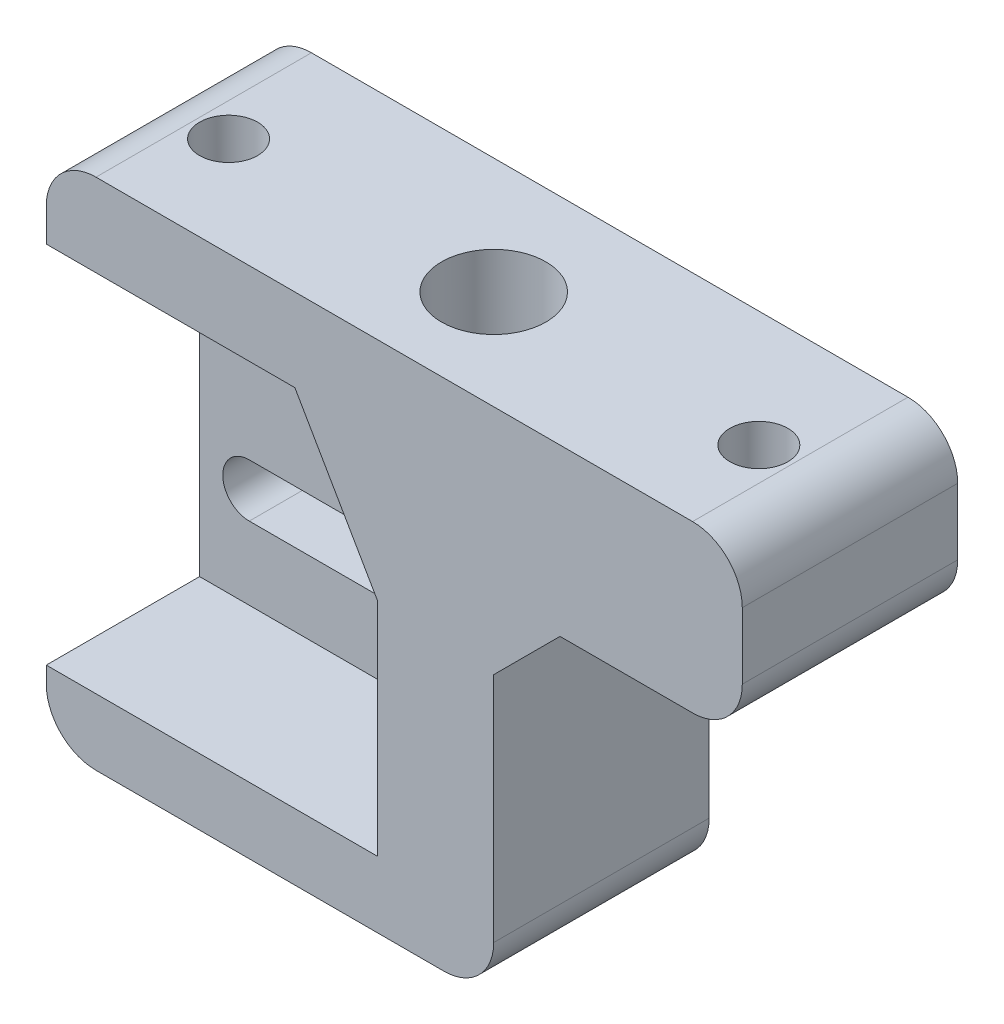
ISO-10303-21;
HEADER;
FILE_DESCRIPTION(('STEP AP214'),'2;1');
FILE_NAME('part.step','',(''),(''),'','','');
FILE_SCHEMA(('AUTOMOTIVE_DESIGN { 1 0 10303 214 1 1 1 1 }'));
ENDSEC;
DATA;
#1=APPLICATION_CONTEXT('core data for automotive mechanical design processes');
#2=APPLICATION_PROTOCOL_DEFINITION('international standard','automotive_design',2000,#1);
#3=PRODUCT_CONTEXT('',#1,'mechanical');
#4=PRODUCT('Part','Part','',(#3));
#5=PRODUCT_RELATED_PRODUCT_CATEGORY('part','',(#4));
#6=PRODUCT_DEFINITION_FORMATION('','',#4);
#7=PRODUCT_DEFINITION_CONTEXT('part definition',#1,'design');
#8=PRODUCT_DEFINITION('design','',#6,#7);
#9=PRODUCT_DEFINITION_SHAPE('','',#8);
#10=(LENGTH_UNIT() NAMED_UNIT(*) SI_UNIT(.MILLI.,.METRE.));
#11=(NAMED_UNIT(*) PLANE_ANGLE_UNIT() SI_UNIT($,.RADIAN.));
#12=(NAMED_UNIT(*) SI_UNIT($,.STERADIAN.) SOLID_ANGLE_UNIT());
#13=UNCERTAINTY_MEASURE_WITH_UNIT(LENGTH_MEASURE(1.E-05),#10,'distance_accuracy_value','');
#14=(GEOMETRIC_REPRESENTATION_CONTEXT(3) GLOBAL_UNCERTAINTY_ASSIGNED_CONTEXT((#13)) GLOBAL_UNIT_ASSIGNED_CONTEXT((#10,
#11,#12)) REPRESENTATION_CONTEXT('',''));
#15=CARTESIAN_POINT('',(0.,0.,0.));
#16=DIRECTION('',(0.,0.,1.));
#17=DIRECTION('',(1.,0.,0.));
#18=AXIS2_PLACEMENT_3D('',#15,#16,#17);
#19=CARTESIAN_POINT('',(30.,0.,14.));
#20=DIRECTION('',(-1.,0.,0.));
#21=DIRECTION('',(0.,0.,1.));
#22=AXIS2_PLACEMENT_3D('',#19,#20,#21);
#23=PLANE('',#22);
#24=DIRECTION('',(0.,1.,0.));
#25=VECTOR('',#24,1.);
#26=CARTESIAN_POINT('',(30.,0.,13.));
#27=LINE('',#26,#25);
#28=CARTESIAN_POINT('',(30.,12.,13.));
#29=VERTEX_POINT('',#28);
#30=CARTESIAN_POINT('',(30.,26.,13.));
#31=VERTEX_POINT('',#30);
#32=EDGE_CURVE('E433',#29,#31,#27,.T.);
#33=ORIENTED_EDGE('',*,*,#32,.F.);
#34=DIRECTION('',(0.,0.,1.));
#35=VECTOR('',#34,1.);
#36=CARTESIAN_POINT('',(30.,12.,14.));
#37=LINE('',#36,#35);
#38=CARTESIAN_POINT('',(30.,12.,0.));
#39=VERTEX_POINT('',#38);
#40=EDGE_CURVE('E411',#29,#39,#37,.F.);
#41=ORIENTED_EDGE('',*,*,#40,.T.);
#42=DIRECTION('',(0.,1.,0.));
#43=VECTOR('',#42,1.);
#44=CARTESIAN_POINT('',(30.,0.,0.));
#45=LINE('',#44,#43);
#46=CARTESIAN_POINT('',(30.,26.,0.));
#47=VERTEX_POINT('',#46);
#48=EDGE_CURVE('E335',#39,#47,#45,.T.);
#49=ORIENTED_EDGE('',*,*,#48,.T.);
#50=DIRECTION('',(0.,0.,1.));
#51=VECTOR('',#50,1.);
#52=CARTESIAN_POINT('',(30.,26.,14.));
#53=LINE('',#52,#51);
#54=EDGE_CURVE('E355',#47,#31,#53,.T.);
#55=ORIENTED_EDGE('',*,*,#54,.T.);
#56=EDGE_LOOP('',(#33,#41,#49,#55));
#57=FACE_BOUND('',#56,.T.);
#58=ADVANCED_FACE('F32',(#57),#23,.F.);
#59=CARTESIAN_POINT('',(0.,40.,14.));
#60=DIRECTION('',(0.,-1.,0.));
#61=DIRECTION('',(0.,0.,-1.));
#62=AXIS2_PLACEMENT_3D('',#59,#60,#61);
#63=PLANE('',#62);
#64=CARTESIAN_POINT('',(8.,40.,7.));
#65=DIRECTION('',(0.,1.,0.));
#66=DIRECTION('',(0.,0.,-1.));
#67=AXIS2_PLACEMENT_3D('',#64,#65,#66);
#68=CIRCLE('',#67,1.75);
#69=CARTESIAN_POINT('',(8.,40.,5.25));
#70=VERTEX_POINT('',#69);
#71=EDGE_CURVE('E364',#70,#70,#68,.T.);
#72=ORIENTED_EDGE('',*,*,#71,.F.);
#73=EDGE_LOOP('',(#72));
#74=FACE_BOUND('',#73,.T.);
#75=CARTESIAN_POINT('',(40.,40.,7.));
#76=DIRECTION('',(0.,1.,0.));
#77=DIRECTION('',(0.,0.,1.));
#78=AXIS2_PLACEMENT_3D('',#75,#76,#77);
#79=CIRCLE('',#78,1.75);
#80=CARTESIAN_POINT('',(40.,40.,8.75));
#81=VERTEX_POINT('',#80);
#82=EDGE_CURVE('E360',#81,#81,#79,.T.);
#83=ORIENTED_EDGE('',*,*,#82,.F.);
#84=EDGE_LOOP('',(#83));
#85=FACE_BOUND('',#84,.T.);
#86=CARTESIAN_POINT('',(24.,40.,7.));
#87=DIRECTION('',(0.,1.,0.));
#88=DIRECTION('',(0.,0.,1.));
#89=AXIS2_PLACEMENT_3D('',#86,#87,#88);
#90=CIRCLE('',#89,3.15);
#91=CARTESIAN_POINT('',(24.,40.,10.15));
#92=VERTEX_POINT('',#91);
#93=EDGE_CURVE('E331',#92,#92,#90,.T.);
#94=ORIENTED_EDGE('',*,*,#93,.F.);
#95=EDGE_LOOP('',(#94));
#96=FACE_BOUND('',#95,.T.);
#97=DIRECTION('',(-1.,0.,0.));
#98=VECTOR('',#97,1.);
#99=CARTESIAN_POINT('',(30.,40.,13.));
#100=LINE('',#99,#98);
#101=CARTESIAN_POINT('',(42.,40.,13.));
#102=VERTEX_POINT('',#101);
#103=CARTESIAN_POINT('',(6.,40.,13.));
#104=VERTEX_POINT('',#103);
#105=EDGE_CURVE('E430',#102,#104,#100,.T.);
#106=ORIENTED_EDGE('',*,*,#105,.F.);
#107=DIRECTION('',(0.,0.,-1.));
#108=VECTOR('',#107,1.);
#109=CARTESIAN_POINT('',(42.,40.,0.));
#110=LINE('',#109,#108);
#111=CARTESIAN_POINT('',(42.,40.,0.));
#112=VERTEX_POINT('',#111);
#113=EDGE_CURVE('E378',#102,#112,#110,.T.);
#114=ORIENTED_EDGE('',*,*,#113,.T.);
#115=DIRECTION('',(-1.,0.,0.));
#116=VECTOR('',#115,1.);
#117=CARTESIAN_POINT('',(0.,40.,0.));
#118=LINE('',#117,#116);
#119=CARTESIAN_POINT('',(6.,40.,0.));
#120=VERTEX_POINT('',#119);
#121=EDGE_CURVE('E339',#112,#120,#118,.T.);
#122=ORIENTED_EDGE('',*,*,#121,.T.);
#123=DIRECTION('',(0.,0.,1.));
#124=VECTOR('',#123,1.);
#125=CARTESIAN_POINT('',(6.,40.,14.));
#126=LINE('',#125,#124);
#127=EDGE_CURVE('E375',#120,#104,#126,.T.);
#128=ORIENTED_EDGE('',*,*,#127,.T.);
#129=EDGE_LOOP('',(#106,#114,#122,#128));
#130=FACE_BOUND('',#129,.T.);
#131=ADVANCED_FACE('F429',(#74,#85,#96,#130),#63,.F.);
#132=CARTESIAN_POINT('',(0.,0.,0.));
#133=DIRECTION('',(0.,0.,-1.));
#134=DIRECTION('',(-1.,0.,0.));
#135=AXIS2_PLACEMENT_3D('',#132,#133,#134);
#136=PLANE('',#135);
#137=ORIENTED_EDGE('',*,*,#121,.F.);
#138=CARTESIAN_POINT('',(42.,37.,0.));
#139=DIRECTION('',(0.,0.,-1.));
#140=DIRECTION('',(-1.,0.,0.));
#141=AXIS2_PLACEMENT_3D('',#138,#139,#140);
#142=CIRCLE('',#141,3.);
#143=CARTESIAN_POINT('',(45.,37.,0.));
#144=VERTEX_POINT('',#143);
#145=EDGE_CURVE('E389',#112,#144,#142,.T.);
#146=ORIENTED_EDGE('',*,*,#145,.T.);
#147=DIRECTION('',(0.,1.,0.));
#148=VECTOR('',#147,1.);
#149=CARTESIAN_POINT('',(45.,30.,0.));
#150=LINE('',#149,#148);
#151=CARTESIAN_POINT('',(45.,33.,0.));
#152=VERTEX_POINT('',#151);
#153=EDGE_CURVE('E509',#152,#144,#150,.T.);
#154=ORIENTED_EDGE('',*,*,#153,.F.);
#155=CARTESIAN_POINT('',(42.,33.,0.));
#156=DIRECTION('',(0.,0.,-1.));
#157=DIRECTION('',(-1.,0.,0.));
#158=AXIS2_PLACEMENT_3D('',#155,#156,#157);
#159=CIRCLE('',#158,3.);
#160=CARTESIAN_POINT('',(42.,30.,0.));
#161=VERTEX_POINT('',#160);
#162=EDGE_CURVE('E387',#152,#161,#159,.T.);
#163=ORIENTED_EDGE('',*,*,#162,.T.);
#164=DIRECTION('',(-1.,0.,0.));
#165=VECTOR('',#164,1.);
#166=CARTESIAN_POINT('',(30.,30.,0.));
#167=LINE('',#166,#165);
#168=CARTESIAN_POINT('',(34.,30.,0.));
#169=VERTEX_POINT('',#168);
#170=EDGE_CURVE('E516',#161,#169,#167,.T.);
#171=ORIENTED_EDGE('',*,*,#170,.T.);
#172=DIRECTION('',(-0.707106781186543,-0.707106781186552,0.));
#173=VECTOR('',#172,1.);
#174=CARTESIAN_POINT('',(30.,26.,0.));
#175=LINE('',#174,#173);
#176=EDGE_CURVE('E372',#169,#47,#175,.T.);
#177=ORIENTED_EDGE('',*,*,#176,.T.);
#178=ORIENTED_EDGE('',*,*,#48,.F.);
#179=CARTESIAN_POINT('',(27.,12.,0.));
#180=DIRECTION('',(0.,0.,-1.));
#181=DIRECTION('',(-1.,0.,0.));
#182=AXIS2_PLACEMENT_3D('',#179,#180,#181);
#183=CIRCLE('',#182,3.);
#184=CARTESIAN_POINT('',(27.,9.,0.));
#185=VERTEX_POINT('',#184);
#186=EDGE_CURVE('E385',#39,#185,#183,.T.);
#187=ORIENTED_EDGE('',*,*,#186,.T.);
#188=DIRECTION('',(-1.,0.,0.));
#189=VECTOR('',#188,1.);
#190=CARTESIAN_POINT('',(0.,9.,0.));
#191=LINE('',#190,#189);
#192=CARTESIAN_POINT('',(6.,9.,0.));
#193=VERTEX_POINT('',#192);
#194=EDGE_CURVE('E434',#185,#193,#191,.T.);
#195=ORIENTED_EDGE('',*,*,#194,.T.);
#196=CARTESIAN_POINT('',(6.,12.,0.));
#197=DIRECTION('',(0.,0.,-1.));
#198=DIRECTION('',(-1.,0.,0.));
#199=AXIS2_PLACEMENT_3D('',#196,#197,#198);
#200=CIRCLE('',#199,3.);
#201=CARTESIAN_POINT('',(3.,12.,0.));
#202=VERTEX_POINT('',#201);
#203=EDGE_CURVE('E383',#193,#202,#200,.T.);
#204=ORIENTED_EDGE('',*,*,#203,.T.);
#205=DIRECTION('',(0.,1.,0.));
#206=VECTOR('',#205,1.);
#207=CARTESIAN_POINT('',(3.,9.,0.));
#208=LINE('',#207,#206);
#209=CARTESIAN_POINT('',(3.,37.,0.));
#210=VERTEX_POINT('',#209);
#211=EDGE_CURVE('E220',#202,#210,#208,.T.);
#212=ORIENTED_EDGE('',*,*,#211,.T.);
#213=CARTESIAN_POINT('',(6.,37.,0.));
#214=DIRECTION('',(0.,0.,-1.));
#215=DIRECTION('',(-1.,0.,0.));
#216=AXIS2_PLACEMENT_3D('',#213,#214,#215);
#217=CIRCLE('',#216,3.);
#218=EDGE_CURVE('E381',#210,#120,#217,.T.);
#219=ORIENTED_EDGE('',*,*,#218,.T.);
#220=EDGE_LOOP('',(#137,#146,#154,#163,#171,#177,#178,#187,#195,#204,#212,#219));
#221=FACE_BOUND('',#220,.T.);
#222=CARTESIAN_POINT('',(6.,19.,0.));
#223=DIRECTION('',(0.,0.,1.));
#224=DIRECTION('',(-1.,0.,0.));
#225=AXIS2_PLACEMENT_3D('',#222,#223,#224);
#226=CIRCLE('',#225,1.6);
#227=CARTESIAN_POINT('',(6.,20.6,0.));
#228=VERTEX_POINT('',#227);
#229=CARTESIAN_POINT('',(6.,17.4,0.));
#230=VERTEX_POINT('',#229);
#231=EDGE_CURVE('E266',#228,#230,#226,.T.);
#232=ORIENTED_EDGE('',*,*,#231,.T.);
#233=DIRECTION('',(1.,0.,0.));
#234=VECTOR('',#233,1.);
#235=CARTESIAN_POINT('',(6.,17.4,0.));
#236=LINE('',#235,#234);
#237=CARTESIAN_POINT('',(14.,17.4,0.));
#238=VERTEX_POINT('',#237);
#239=EDGE_CURVE('E269',#230,#238,#236,.T.);
#240=ORIENTED_EDGE('',*,*,#239,.T.);
#241=CARTESIAN_POINT('',(14.,19.,0.));
#242=DIRECTION('',(0.,0.,1.));
#243=DIRECTION('',(-1.,0.,0.));
#244=AXIS2_PLACEMENT_3D('',#241,#242,#243);
#245=CIRCLE('',#244,1.6);
#246=CARTESIAN_POINT('',(14.,20.6,0.));
#247=VERTEX_POINT('',#246);
#248=EDGE_CURVE('E273',#238,#247,#245,.T.);
#249=ORIENTED_EDGE('',*,*,#248,.T.);
#250=DIRECTION('',(-1.,0.,0.));
#251=VECTOR('',#250,1.);
#252=CARTESIAN_POINT('',(6.,20.6,0.));
#253=LINE('',#252,#251);
#254=EDGE_CURVE('E276',#247,#228,#253,.T.);
#255=ORIENTED_EDGE('',*,*,#254,.T.);
#256=EDGE_LOOP('',(#232,#240,#249,#255));
#257=FACE_BOUND('',#256,.T.);
#258=CARTESIAN_POINT('',(6.,29.,0.));
#259=DIRECTION('',(0.,0.,1.));
#260=DIRECTION('',(1.,0.,0.));
#261=AXIS2_PLACEMENT_3D('',#258,#259,#260);
#262=CIRCLE('',#261,1.6);
#263=CARTESIAN_POINT('',(6.,30.6,0.));
#264=VERTEX_POINT('',#263);
#265=CARTESIAN_POINT('',(6.,27.4,0.));
#266=VERTEX_POINT('',#265);
#267=EDGE_CURVE('E297',#264,#266,#262,.T.);
#268=ORIENTED_EDGE('',*,*,#267,.T.);
#269=DIRECTION('',(1.,0.,0.));
#270=VECTOR('',#269,1.);
#271=CARTESIAN_POINT('',(6.,27.4,0.));
#272=LINE('',#271,#270);
#273=CARTESIAN_POINT('',(14.,27.4,0.));
#274=VERTEX_POINT('',#273);
#275=EDGE_CURVE('E300',#266,#274,#272,.T.);
#276=ORIENTED_EDGE('',*,*,#275,.T.);
#277=CARTESIAN_POINT('',(14.,29.,0.));
#278=DIRECTION('',(0.,0.,1.));
#279=DIRECTION('',(1.,0.,0.));
#280=AXIS2_PLACEMENT_3D('',#277,#278,#279);
#281=CIRCLE('',#280,1.6);
#282=CARTESIAN_POINT('',(14.,30.6,0.));
#283=VERTEX_POINT('',#282);
#284=EDGE_CURVE('E304',#274,#283,#281,.T.);
#285=ORIENTED_EDGE('',*,*,#284,.T.);
#286=DIRECTION('',(-1.,0.,0.));
#287=VECTOR('',#286,1.);
#288=CARTESIAN_POINT('',(6.,30.6,0.));
#289=LINE('',#288,#287);
#290=EDGE_CURVE('E307',#283,#264,#289,.T.);
#291=ORIENTED_EDGE('',*,*,#290,.T.);
#292=EDGE_LOOP('',(#268,#276,#285,#291));
#293=FACE_BOUND('',#292,.T.);
#294=ADVANCED_FACE('F420',(#221,#257,#293),#136,.T.);
#295=CARTESIAN_POINT('',(24.,10.,7.));
#296=DIRECTION('',(0.,1.,0.));
#297=DIRECTION('',(0.,0.,1.));
#298=AXIS2_PLACEMENT_3D('',#295,#296,#297);
#299=CYLINDRICAL_SURFACE('',#298,3.15);
#300=DIRECTION('',(0.,1.,0.));
#301=VECTOR('',#300,1.);
#302=CARTESIAN_POINT('',(23.,10.,4.01294459375123));
#303=LINE('',#302,#301);
#304=CARTESIAN_POINT('',(23.,26.3397459621555,4.01294459375124));
#305=VERTEX_POINT('',#304);
#306=CARTESIAN_POINT('',(23.,13.,4.01294459375123));
#307=VERTEX_POINT('',#306);
#308=EDGE_CURVE('E352',#305,#307,#303,.F.);
#309=ORIENTED_EDGE('',*,*,#308,.T.);
#310=CARTESIAN_POINT('',(24.,13.,7.));
#311=DIRECTION('',(0.,-1.,0.));
#312=DIRECTION('',(1.,0.,0.));
#313=AXIS2_PLACEMENT_3D('',#310,#311,#312);
#314=CIRCLE('',#313,3.15);
#315=CARTESIAN_POINT('',(23.,13.,9.98705540624877));
#316=VERTEX_POINT('',#315);
#317=EDGE_CURVE('E259',#307,#316,#314,.F.);
#318=ORIENTED_EDGE('',*,*,#317,.T.);
#319=DIRECTION('',(0.,1.,0.));
#320=VECTOR('',#319,1.);
#321=CARTESIAN_POINT('',(23.,10.,9.98705540624877));
#322=LINE('',#321,#320);
#323=CARTESIAN_POINT('',(23.,26.3397459621555,9.98705540624877));
#324=VERTEX_POINT('',#323);
#325=EDGE_CURVE('E349',#316,#324,#322,.T.);
#326=ORIENTED_EDGE('',*,*,#325,.T.);
#327=CARTESIAN_POINT('',(24.,24.6076951545866,7.));
#328=DIRECTION('',(0.866025403784442,0.499999999999995,0.));
#329=DIRECTION('',(-0.499999999999995,0.866025403784441,0.));
#330=AXIS2_PLACEMENT_3D('',#327,#328,#329);
#331=ELLIPSE('',#330,6.30000000000006,3.15);
#332=EDGE_CURVE('E346',#324,#305,#331,.F.);
#333=ORIENTED_EDGE('',*,*,#332,.T.);
#334=EDGE_LOOP('',(#309,#318,#326,#333));
#335=FACE_BOUND('',#334,.T.);
#336=CARTESIAN_POINT('',(24.,10.,7.));
#337=DIRECTION('',(0.,1.,0.));
#338=DIRECTION('',(0.,0.,1.));
#339=AXIS2_PLACEMENT_3D('',#336,#337,#338);
#340=CIRCLE('',#339,3.15);
#341=CARTESIAN_POINT('',(24.,10.,10.15));
#342=VERTEX_POINT('',#341);
#343=EDGE_CURVE('E332',#342,#342,#340,.T.);
#344=ORIENTED_EDGE('',*,*,#343,.F.);
#345=EDGE_LOOP('',(#344));
#346=FACE_BOUND('',#345,.T.);
#347=ORIENTED_EDGE('',*,*,#93,.T.);
#348=EDGE_LOOP('',(#347));
#349=FACE_BOUND('',#348,.T.);
#350=ADVANCED_FACE('F458',(#335,#346,#349),#299,.F.);
#351=CARTESIAN_POINT('',(24.,10.,7.));
#352=DIRECTION('',(0.,1.,0.));
#353=DIRECTION('',(0.,0.,1.));
#354=AXIS2_PLACEMENT_3D('',#351,#352,#353);
#355=PLANE('',#354);
#356=ORIENTED_EDGE('',*,*,#343,.T.);
#357=EDGE_LOOP('',(#356));
#358=FACE_BOUND('',#357,.T.);
#359=ADVANCED_FACE('F535',(#358),#355,.T.);
#360=CARTESIAN_POINT('',(0.,35.,3.75));
#361=DIRECTION('',(0.,1.,0.));
#362=DIRECTION('',(0.,0.,1.));
#363=AXIS2_PLACEMENT_3D('',#360,#361,#362);
#364=PLANE('',#363);
#365=CARTESIAN_POINT('',(8.,35.,7.));
#366=DIRECTION('',(0.,1.,0.));
#367=DIRECTION('',(0.,0.,1.));
#368=AXIS2_PLACEMENT_3D('',#365,#366,#367);
#369=CIRCLE('',#368,1.75);
#370=CARTESIAN_POINT('',(8.,35.,8.75));
#371=VERTEX_POINT('',#370);
#372=EDGE_CURVE('E361',#371,#371,#369,.T.);
#373=ORIENTED_EDGE('',*,*,#372,.T.);
#374=EDGE_LOOP('',(#373));
#375=FACE_BOUND('',#374,.T.);
#376=DIRECTION('',(-1.,0.,0.));
#377=VECTOR('',#376,1.);
#378=CARTESIAN_POINT('',(0.,35.,13.));
#379=LINE('',#378,#377);
#380=CARTESIAN_POINT('',(18.,35.,13.));
#381=VERTEX_POINT('',#380);
#382=CARTESIAN_POINT('',(3.,35.,13.));
#383=VERTEX_POINT('',#382);
#384=EDGE_CURVE('E238',#381,#383,#379,.T.);
#385=ORIENTED_EDGE('',*,*,#384,.T.);
#386=DIRECTION('',(0.,0.,-1.));
#387=VECTOR('',#386,1.);
#388=CARTESIAN_POINT('',(3.,35.,3.75));
#389=LINE('',#388,#387);
#390=CARTESIAN_POINT('',(3.,35.,3.75));
#391=VERTEX_POINT('',#390);
#392=EDGE_CURVE('E449',#383,#391,#389,.T.);
#393=ORIENTED_EDGE('',*,*,#392,.T.);
#394=DIRECTION('',(-1.,0.,0.));
#395=VECTOR('',#394,1.);
#396=CARTESIAN_POINT('',(0.,35.,3.75));
#397=LINE('',#396,#395);
#398=CARTESIAN_POINT('',(18.,35.,3.75));
#399=VERTEX_POINT('',#398);
#400=EDGE_CURVE('E328',#399,#391,#397,.T.);
#401=ORIENTED_EDGE('',*,*,#400,.F.);
#402=DIRECTION('',(0.,0.,1.));
#403=VECTOR('',#402,1.);
#404=CARTESIAN_POINT('',(18.,35.,-19.6593998214393));
#405=LINE('',#404,#403);
#406=EDGE_CURVE('E250',#399,#381,#405,.T.);
#407=ORIENTED_EDGE('',*,*,#406,.T.);
#408=EDGE_LOOP('',(#385,#393,#401,#407));
#409=FACE_BOUND('',#408,.T.);
#410=ADVANCED_FACE('F447',(#375,#409),#364,.F.);
#411=CARTESIAN_POINT('',(0.,13.,3.75));
#412=DIRECTION('',(0.,-1.,0.));
#413=DIRECTION('',(0.,0.,-1.));
#414=AXIS2_PLACEMENT_3D('',#411,#412,#413);
#415=PLANE('',#414);
#416=DIRECTION('',(1.,0.,0.));
#417=VECTOR('',#416,1.);
#418=CARTESIAN_POINT('',(0.,13.,3.75));
#419=LINE('',#418,#417);
#420=CARTESIAN_POINT('',(3.,13.,3.75));
#421=VERTEX_POINT('',#420);
#422=CARTESIAN_POINT('',(23.,13.,3.75));
#423=VERTEX_POINT('',#422);
#424=EDGE_CURVE('E230',#421,#423,#419,.T.);
#425=ORIENTED_EDGE('',*,*,#424,.F.);
#426=DIRECTION('',(0.,0.,1.));
#427=VECTOR('',#426,1.);
#428=CARTESIAN_POINT('',(3.,13.,3.75));
#429=LINE('',#428,#427);
#430=CARTESIAN_POINT('',(3.,13.,13.));
#431=VERTEX_POINT('',#430);
#432=EDGE_CURVE('E216',#421,#431,#429,.T.);
#433=ORIENTED_EDGE('',*,*,#432,.T.);
#434=DIRECTION('',(1.,0.,0.));
#435=VECTOR('',#434,1.);
#436=CARTESIAN_POINT('',(0.,13.,13.));
#437=LINE('',#436,#435);
#438=CARTESIAN_POINT('',(23.,13.,13.));
#439=VERTEX_POINT('',#438);
#440=EDGE_CURVE('E227',#431,#439,#437,.T.);
#441=ORIENTED_EDGE('',*,*,#440,.T.);
#442=DIRECTION('',(0.,0.,1.));
#443=VECTOR('',#442,1.);
#444=CARTESIAN_POINT('',(23.,13.,-19.6593998214393));
#445=LINE('',#444,#443);
#446=EDGE_CURVE('E241',#316,#439,#445,.T.);
#447=ORIENTED_EDGE('',*,*,#446,.F.);
#448=ORIENTED_EDGE('',*,*,#317,.F.);
#449=EDGE_CURVE('E256',#423,#307,#445,.T.);
#450=ORIENTED_EDGE('',*,*,#449,.F.);
#451=EDGE_LOOP('',(#425,#433,#441,#447,#448,#450));
#452=FACE_BOUND('',#451,.T.);
#453=ADVANCED_FACE('F225',(#452),#415,.F.);
#454=CARTESIAN_POINT('',(0.,0.,3.75));
#455=DIRECTION('',(0.,0.,-1.));
#456=DIRECTION('',(-1.,0.,0.));
#457=AXIS2_PLACEMENT_3D('',#454,#455,#456);
#458=PLANE('',#457);
#459=CARTESIAN_POINT('',(14.,19.,3.75));
#460=DIRECTION('',(0.,0.,-1.));
#461=DIRECTION('',(-1.,0.,0.));
#462=AXIS2_PLACEMENT_3D('',#459,#460,#461);
#463=CIRCLE('',#462,1.6);
#464=CARTESIAN_POINT('',(14.,20.6,3.75));
#465=VERTEX_POINT('',#464);
#466=CARTESIAN_POINT('',(14.,17.4,3.75));
#467=VERTEX_POINT('',#466);
#468=EDGE_CURVE('E344',#465,#467,#463,.T.);
#469=ORIENTED_EDGE('',*,*,#468,.T.);
#470=DIRECTION('',(1.,0.,0.));
#471=VECTOR('',#470,1.);
#472=CARTESIAN_POINT('',(6.,17.4,3.75));
#473=LINE('',#472,#471);
#474=CARTESIAN_POINT('',(6.,17.4,3.75));
#475=VERTEX_POINT('',#474);
#476=EDGE_CURVE('E281',#475,#467,#473,.T.);
#477=ORIENTED_EDGE('',*,*,#476,.F.);
#478=CARTESIAN_POINT('',(6.,19.,3.75));
#479=DIRECTION('',(0.,0.,1.));
#480=DIRECTION('',(-1.,0.,0.));
#481=AXIS2_PLACEMENT_3D('',#478,#479,#480);
#482=CIRCLE('',#481,1.6);
#483=CARTESIAN_POINT('',(6.,20.6,3.75));
#484=VERTEX_POINT('',#483);
#485=EDGE_CURVE('E265',#484,#475,#482,.T.);
#486=ORIENTED_EDGE('',*,*,#485,.F.);
#487=DIRECTION('',(-1.,0.,0.));
#488=VECTOR('',#487,1.);
#489=CARTESIAN_POINT('',(6.,20.6,3.75));
#490=LINE('',#489,#488);
#491=EDGE_CURVE('E270',#465,#484,#490,.T.);
#492=ORIENTED_EDGE('',*,*,#491,.F.);
#493=EDGE_LOOP('',(#469,#477,#486,#492));
#494=FACE_BOUND('',#493,.T.);
#495=CARTESIAN_POINT('',(14.,29.,3.75));
#496=DIRECTION('',(0.,0.,-1.));
#497=DIRECTION('',(-1.,0.,0.));
#498=AXIS2_PLACEMENT_3D('',#495,#496,#497);
#499=CIRCLE('',#498,1.6);
#500=CARTESIAN_POINT('',(14.,30.6,3.75));
#501=VERTEX_POINT('',#500);
#502=CARTESIAN_POINT('',(14.,27.4,3.75));
#503=VERTEX_POINT('',#502);
#504=EDGE_CURVE('E342',#501,#503,#499,.T.);
#505=ORIENTED_EDGE('',*,*,#504,.T.);
#506=DIRECTION('',(1.,0.,0.));
#507=VECTOR('',#506,1.);
#508=CARTESIAN_POINT('',(6.,27.4,3.75));
#509=LINE('',#508,#507);
#510=CARTESIAN_POINT('',(6.,27.4,3.75));
#511=VERTEX_POINT('',#510);
#512=EDGE_CURVE('E312',#511,#503,#509,.T.);
#513=ORIENTED_EDGE('',*,*,#512,.F.);
#514=CARTESIAN_POINT('',(6.,29.,3.75));
#515=DIRECTION('',(0.,0.,1.));
#516=DIRECTION('',(1.,0.,0.));
#517=AXIS2_PLACEMENT_3D('',#514,#515,#516);
#518=CIRCLE('',#517,1.6);
#519=CARTESIAN_POINT('',(6.,30.6,3.75));
#520=VERTEX_POINT('',#519);
#521=EDGE_CURVE('E288',#520,#511,#518,.T.);
#522=ORIENTED_EDGE('',*,*,#521,.F.);
#523=DIRECTION('',(-1.,0.,0.));
#524=VECTOR('',#523,1.);
#525=CARTESIAN_POINT('',(6.,30.6,3.75));
#526=LINE('',#525,#524);
#527=EDGE_CURVE('E301',#501,#520,#526,.T.);
#528=ORIENTED_EDGE('',*,*,#527,.F.);
#529=EDGE_LOOP('',(#505,#513,#522,#528));
#530=FACE_BOUND('',#529,.T.);
#531=ORIENTED_EDGE('',*,*,#400,.T.);
#532=DIRECTION('',(0.,-1.,0.));
#533=VECTOR('',#532,1.);
#534=CARTESIAN_POINT('',(3.,0.,3.75));
#535=LINE('',#534,#533);
#536=EDGE_CURVE('E231',#391,#421,#535,.T.);
#537=ORIENTED_EDGE('',*,*,#536,.T.);
#538=ORIENTED_EDGE('',*,*,#424,.T.);
#539=DIRECTION('',(0.,1.,0.));
#540=VECTOR('',#539,1.);
#541=CARTESIAN_POINT('',(23.,26.3397459621555,3.75));
#542=LINE('',#541,#540);
#543=CARTESIAN_POINT('',(23.,26.3397459621555,3.75));
#544=VERTEX_POINT('',#543);
#545=EDGE_CURVE('E252',#423,#544,#542,.T.);
#546=ORIENTED_EDGE('',*,*,#545,.T.);
#547=DIRECTION('',(-0.499999999999995,0.866025403784441,0.));
#548=VECTOR('',#547,1.);
#549=CARTESIAN_POINT('',(18.,35.,3.75));
#550=LINE('',#549,#548);
#551=EDGE_CURVE('E247',#544,#399,#550,.T.);
#552=ORIENTED_EDGE('',*,*,#551,.T.);
#553=EDGE_LOOP('',(#531,#537,#538,#546,#552));
#554=FACE_BOUND('',#553,.T.);
#555=ADVANCED_FACE('F451',(#494,#530,#554),#458,.F.);
#556=CARTESIAN_POINT('',(6.,29.,0.));
#557=DIRECTION('',(0.,0.,1.));
#558=DIRECTION('',(1.,0.,0.));
#559=AXIS2_PLACEMENT_3D('',#556,#557,#558);
#560=CYLINDRICAL_SURFACE('',#559,1.6);
#561=ORIENTED_EDGE('',*,*,#521,.T.);
#562=DIRECTION('',(0.,0.,1.));
#563=VECTOR('',#562,1.);
#564=CARTESIAN_POINT('',(6.,27.4,0.));
#565=LINE('',#564,#563);
#566=EDGE_CURVE('E310',#266,#511,#565,.T.);
#567=ORIENTED_EDGE('',*,*,#566,.F.);
#568=ORIENTED_EDGE('',*,*,#267,.F.);
#569=DIRECTION('',(0.,0.,1.));
#570=VECTOR('',#569,1.);
#571=CARTESIAN_POINT('',(6.,30.6,0.));
#572=LINE('',#571,#570);
#573=EDGE_CURVE('E317',#264,#520,#572,.T.);
#574=ORIENTED_EDGE('',*,*,#573,.T.);
#575=EDGE_LOOP('',(#561,#567,#568,#574));
#576=FACE_BOUND('',#575,.T.);
#577=ADVANCED_FACE('F551',(#576),#560,.F.);
#578=CARTESIAN_POINT('',(6.,30.6,0.));
#579=DIRECTION('',(0.,1.,0.));
#580=DIRECTION('',(0.,0.,1.));
#581=AXIS2_PLACEMENT_3D('',#578,#579,#580);
#582=PLANE('',#581);
#583=ORIENTED_EDGE('',*,*,#527,.T.);
#584=ORIENTED_EDGE('',*,*,#573,.F.);
#585=ORIENTED_EDGE('',*,*,#290,.F.);
#586=DIRECTION('',(0.,0.,1.));
#587=VECTOR('',#586,1.);
#588=CARTESIAN_POINT('',(14.,30.6,0.));
#589=LINE('',#588,#587);
#590=EDGE_CURVE('E319',#283,#501,#589,.T.);
#591=ORIENTED_EDGE('',*,*,#590,.T.);
#592=EDGE_LOOP('',(#583,#584,#585,#591));
#593=FACE_BOUND('',#592,.T.);
#594=ADVANCED_FACE('F555',(#593),#582,.F.);
#595=CARTESIAN_POINT('',(14.,29.,0.));
#596=DIRECTION('',(0.,0.,1.));
#597=DIRECTION('',(1.,0.,0.));
#598=AXIS2_PLACEMENT_3D('',#595,#596,#597);
#599=CYLINDRICAL_SURFACE('',#598,1.6);
#600=DIRECTION('',(0.,0.,1.));
#601=VECTOR('',#600,1.);
#602=CARTESIAN_POINT('',(14.,27.4,0.));
#603=LINE('',#602,#601);
#604=EDGE_CURVE('E322',#274,#503,#603,.T.);
#605=ORIENTED_EDGE('',*,*,#604,.T.);
#606=ORIENTED_EDGE('',*,*,#504,.F.);
#607=ORIENTED_EDGE('',*,*,#590,.F.);
#608=ORIENTED_EDGE('',*,*,#284,.F.);
#609=EDGE_LOOP('',(#605,#606,#607,#608));
#610=FACE_BOUND('',#609,.T.);
#611=ADVANCED_FACE('F561',(#610),#599,.F.);
#612=CARTESIAN_POINT('',(6.,27.4,0.));
#613=DIRECTION('',(0.,-1.,0.));
#614=DIRECTION('',(0.,0.,-1.));
#615=AXIS2_PLACEMENT_3D('',#612,#613,#614);
#616=PLANE('',#615);
#617=ORIENTED_EDGE('',*,*,#512,.T.);
#618=ORIENTED_EDGE('',*,*,#604,.F.);
#619=ORIENTED_EDGE('',*,*,#275,.F.);
#620=ORIENTED_EDGE('',*,*,#566,.T.);
#621=EDGE_LOOP('',(#617,#618,#619,#620));
#622=FACE_BOUND('',#621,.T.);
#623=ADVANCED_FACE('F557',(#622),#616,.F.);
#624=CARTESIAN_POINT('',(6.,19.,0.));
#625=DIRECTION('',(0.,0.,1.));
#626=DIRECTION('',(1.,0.,0.));
#627=AXIS2_PLACEMENT_3D('',#624,#625,#626);
#628=CYLINDRICAL_SURFACE('',#627,1.6);
#629=ORIENTED_EDGE('',*,*,#485,.T.);
#630=DIRECTION('',(0.,0.,1.));
#631=VECTOR('',#630,1.);
#632=CARTESIAN_POINT('',(6.,17.4,0.));
#633=LINE('',#632,#631);
#634=EDGE_CURVE('E279',#230,#475,#633,.T.);
#635=ORIENTED_EDGE('',*,*,#634,.F.);
#636=ORIENTED_EDGE('',*,*,#231,.F.);
#637=DIRECTION('',(0.,0.,1.));
#638=VECTOR('',#637,1.);
#639=CARTESIAN_POINT('',(6.,20.6,0.));
#640=LINE('',#639,#638);
#641=EDGE_CURVE('E286',#228,#484,#640,.T.);
#642=ORIENTED_EDGE('',*,*,#641,.T.);
#643=EDGE_LOOP('',(#629,#635,#636,#642));
#644=FACE_BOUND('',#643,.T.);
#645=ADVANCED_FACE('F560',(#644),#628,.F.);
#646=CARTESIAN_POINT('',(6.,20.6,0.));
#647=DIRECTION('',(0.,1.,0.));
#648=DIRECTION('',(0.,0.,1.));
#649=AXIS2_PLACEMENT_3D('',#646,#647,#648);
#650=PLANE('',#649);
#651=ORIENTED_EDGE('',*,*,#491,.T.);
#652=ORIENTED_EDGE('',*,*,#641,.F.);
#653=ORIENTED_EDGE('',*,*,#254,.F.);
#654=DIRECTION('',(0.,0.,1.));
#655=VECTOR('',#654,1.);
#656=CARTESIAN_POINT('',(14.,20.6,0.));
#657=LINE('',#656,#655);
#658=EDGE_CURVE('E289',#247,#465,#657,.T.);
#659=ORIENTED_EDGE('',*,*,#658,.T.);
#660=EDGE_LOOP('',(#651,#652,#653,#659));
#661=FACE_BOUND('',#660,.T.);
#662=ADVANCED_FACE('F571',(#661),#650,.F.);
#663=CARTESIAN_POINT('',(14.,19.,0.));
#664=DIRECTION('',(0.,0.,1.));
#665=DIRECTION('',(1.,0.,0.));
#666=AXIS2_PLACEMENT_3D('',#663,#664,#665);
#667=CYLINDRICAL_SURFACE('',#666,1.6);
#668=DIRECTION('',(0.,0.,1.));
#669=VECTOR('',#668,1.);
#670=CARTESIAN_POINT('',(14.,17.4,0.));
#671=LINE('',#670,#669);
#672=EDGE_CURVE('E292',#238,#467,#671,.T.);
#673=ORIENTED_EDGE('',*,*,#672,.T.);
#674=ORIENTED_EDGE('',*,*,#468,.F.);
#675=ORIENTED_EDGE('',*,*,#658,.F.);
#676=ORIENTED_EDGE('',*,*,#248,.F.);
#677=EDGE_LOOP('',(#673,#674,#675,#676));
#678=FACE_BOUND('',#677,.T.);
#679=ADVANCED_FACE('F575',(#678),#667,.F.);
#680=CARTESIAN_POINT('',(6.,17.4,0.));
#681=DIRECTION('',(0.,-1.,0.));
#682=DIRECTION('',(0.,0.,-1.));
#683=AXIS2_PLACEMENT_3D('',#680,#681,#682);
#684=PLANE('',#683);
#685=ORIENTED_EDGE('',*,*,#476,.T.);
#686=ORIENTED_EDGE('',*,*,#672,.F.);
#687=ORIENTED_EDGE('',*,*,#239,.F.);
#688=ORIENTED_EDGE('',*,*,#634,.T.);
#689=EDGE_LOOP('',(#685,#686,#687,#688));
#690=FACE_BOUND('',#689,.T.);
#691=ADVANCED_FACE('F469',(#690),#684,.F.);
#692=CARTESIAN_POINT('',(23.,26.3397459621555,-19.6593998214393));
#693=DIRECTION('',(1.,0.,0.));
#694=DIRECTION('',(0.,1.,0.));
#695=AXIS2_PLACEMENT_3D('',#692,#693,#694);
#696=PLANE('',#695);
#697=DIRECTION('',(0.,0.,1.));
#698=VECTOR('',#697,1.);
#699=CARTESIAN_POINT('',(23.,26.3397459621555,-19.6593998214393));
#700=LINE('',#699,#698);
#701=EDGE_CURVE('E251',#544,#305,#700,.T.);
#702=ORIENTED_EDGE('',*,*,#701,.F.);
#703=ORIENTED_EDGE('',*,*,#545,.F.);
#704=ORIENTED_EDGE('',*,*,#449,.T.);
#705=ORIENTED_EDGE('',*,*,#308,.F.);
#706=EDGE_LOOP('',(#702,#703,#704,#705));
#707=FACE_BOUND('',#706,.T.);
#708=ADVANCED_FACE('F456',(#707),#696,.F.);
#709=ORIENTED_EDGE('',*,*,#446,.T.);
#710=DIRECTION('',(0.,1.,0.));
#711=VECTOR('',#710,1.);
#712=CARTESIAN_POINT('',(23.,26.3397459621555,13.));
#713=LINE('',#712,#711);
#714=CARTESIAN_POINT('',(23.,26.3397459621555,13.));
#715=VERTEX_POINT('',#714);
#716=EDGE_CURVE('E236',#439,#715,#713,.T.);
#717=ORIENTED_EDGE('',*,*,#716,.T.);
#718=EDGE_CURVE('E255',#324,#715,#700,.T.);
#719=ORIENTED_EDGE('',*,*,#718,.F.);
#720=ORIENTED_EDGE('',*,*,#325,.F.);
#721=EDGE_LOOP('',(#709,#717,#719,#720));
#722=FACE_BOUND('',#721,.T.);
#723=ADVANCED_FACE('F461',(#722),#696,.F.);
#724=CARTESIAN_POINT('',(18.,35.,-19.6593998214393));
#725=DIRECTION('',(0.866025403784442,0.499999999999995,0.));
#726=DIRECTION('',(-0.499999999999995,0.866025403784441,0.));
#727=AXIS2_PLACEMENT_3D('',#724,#725,#726);
#728=PLANE('',#727);
#729=ORIENTED_EDGE('',*,*,#718,.T.);
#730=DIRECTION('',(-0.499999999999995,0.866025403784441,0.));
#731=VECTOR('',#730,1.);
#732=CARTESIAN_POINT('',(18.,35.,13.));
#733=LINE('',#732,#731);
#734=EDGE_CURVE('E243',#715,#381,#733,.T.);
#735=ORIENTED_EDGE('',*,*,#734,.T.);
#736=ORIENTED_EDGE('',*,*,#406,.F.);
#737=ORIENTED_EDGE('',*,*,#551,.F.);
#738=ORIENTED_EDGE('',*,*,#701,.T.);
#739=ORIENTED_EDGE('',*,*,#332,.F.);
#740=EDGE_LOOP('',(#729,#735,#736,#737,#738,#739));
#741=FACE_BOUND('',#740,.T.);
#742=ADVANCED_FACE('F444',(#741),#728,.F.);
#743=CARTESIAN_POINT('',(30.,0.,13.));
#744=DIRECTION('',(0.,0.,-1.));
#745=DIRECTION('',(-1.,0.,0.));
#746=AXIS2_PLACEMENT_3D('',#743,#744,#745);
#747=PLANE('',#746);
#748=DIRECTION('',(0.,1.,0.));
#749=VECTOR('',#748,1.);
#750=CARTESIAN_POINT('',(45.,30.,13.));
#751=LINE('',#750,#749);
#752=CARTESIAN_POINT('',(45.,33.,13.));
#753=VERTEX_POINT('',#752);
#754=CARTESIAN_POINT('',(45.,37.,13.));
#755=VERTEX_POINT('',#754);
#756=EDGE_CURVE('E511',#753,#755,#751,.T.);
#757=ORIENTED_EDGE('',*,*,#756,.T.);
#758=CARTESIAN_POINT('',(42.,37.,13.));
#759=DIRECTION('',(0.,0.,-1.));
#760=DIRECTION('',(-1.,0.,0.));
#761=AXIS2_PLACEMENT_3D('',#758,#759,#760);
#762=CIRCLE('',#761,3.);
#763=EDGE_CURVE('E403',#755,#102,#762,.F.);
#764=ORIENTED_EDGE('',*,*,#763,.T.);
#765=ORIENTED_EDGE('',*,*,#105,.T.);
#766=CARTESIAN_POINT('',(6.,37.,13.));
#767=DIRECTION('',(0.,0.,-1.));
#768=DIRECTION('',(-1.,0.,0.));
#769=AXIS2_PLACEMENT_3D('',#766,#767,#768);
#770=CIRCLE('',#769,3.);
#771=CARTESIAN_POINT('',(3.,37.,13.));
#772=VERTEX_POINT('',#771);
#773=EDGE_CURVE('E396',#104,#772,#770,.F.);
#774=ORIENTED_EDGE('',*,*,#773,.T.);
#775=DIRECTION('',(0.,-1.,0.));
#776=VECTOR('',#775,1.);
#777=CARTESIAN_POINT('',(3.,0.,13.));
#778=LINE('',#777,#776);
#779=EDGE_CURVE('E222',#772,#383,#778,.T.);
#780=ORIENTED_EDGE('',*,*,#779,.T.);
#781=ORIENTED_EDGE('',*,*,#384,.F.);
#782=ORIENTED_EDGE('',*,*,#734,.F.);
#783=ORIENTED_EDGE('',*,*,#716,.F.);
#784=ORIENTED_EDGE('',*,*,#440,.F.);
#785=CARTESIAN_POINT('',(3.,12.,13.));
#786=VERTEX_POINT('',#785);
#787=EDGE_CURVE('E212',#431,#786,#778,.T.);
#788=ORIENTED_EDGE('',*,*,#787,.T.);
#789=CARTESIAN_POINT('',(6.,12.,13.));
#790=DIRECTION('',(0.,0.,-1.));
#791=DIRECTION('',(-1.,0.,0.));
#792=AXIS2_PLACEMENT_3D('',#789,#790,#791);
#793=CIRCLE('',#792,3.);
#794=CARTESIAN_POINT('',(6.,9.,13.));
#795=VERTEX_POINT('',#794);
#796=EDGE_CURVE('E398',#786,#795,#793,.F.);
#797=ORIENTED_EDGE('',*,*,#796,.T.);
#798=DIRECTION('',(-1.,0.,0.));
#799=VECTOR('',#798,1.);
#800=CARTESIAN_POINT('',(0.,9.,13.));
#801=LINE('',#800,#799);
#802=CARTESIAN_POINT('',(27.,9.,13.));
#803=VERTEX_POINT('',#802);
#804=EDGE_CURVE('E437',#803,#795,#801,.T.);
#805=ORIENTED_EDGE('',*,*,#804,.F.);
#806=CARTESIAN_POINT('',(27.,12.,13.));
#807=DIRECTION('',(0.,0.,-1.));
#808=DIRECTION('',(-1.,0.,0.));
#809=AXIS2_PLACEMENT_3D('',#806,#807,#808);
#810=CIRCLE('',#809,3.);
#811=EDGE_CURVE('E55',#803,#29,#810,.F.);
#812=ORIENTED_EDGE('',*,*,#811,.T.);
#813=ORIENTED_EDGE('',*,*,#32,.T.);
#814=DIRECTION('',(0.707106781186543,0.707106781186552,0.));
#815=VECTOR('',#814,1.);
#816=CARTESIAN_POINT('',(17.,12.9999999999998,13.));
#817=LINE('',#816,#815);
#818=CARTESIAN_POINT('',(34.,30.,13.));
#819=VERTEX_POINT('',#818);
#820=EDGE_CURVE('E370',#31,#819,#817,.T.);
#821=ORIENTED_EDGE('',*,*,#820,.T.);
#822=DIRECTION('',(1.,0.,0.));
#823=VECTOR('',#822,1.);
#824=CARTESIAN_POINT('',(30.,30.,13.));
#825=LINE('',#824,#823);
#826=CARTESIAN_POINT('',(42.,30.,13.));
#827=VERTEX_POINT('',#826);
#828=EDGE_CURVE('E359',#819,#827,#825,.T.);
#829=ORIENTED_EDGE('',*,*,#828,.T.);
#830=CARTESIAN_POINT('',(42.,33.,13.));
#831=DIRECTION('',(0.,0.,-1.));
#832=DIRECTION('',(-1.,0.,0.));
#833=AXIS2_PLACEMENT_3D('',#830,#831,#832);
#834=CIRCLE('',#833,3.);
#835=EDGE_CURVE('E401',#827,#753,#834,.F.);
#836=ORIENTED_EDGE('',*,*,#835,.T.);
#837=EDGE_LOOP('',(#757,#764,#765,#774,#780,#781,#782,#783,#784,#788,#797,#805,#812,#813,#821,
#829,#836));
#838=FACE_BOUND('',#837,.T.);
#839=ADVANCED_FACE('F234',(#838),#747,.F.);
#840=CARTESIAN_POINT('',(0.,9.,0.));
#841=DIRECTION('',(0.,1.,0.));
#842=DIRECTION('',(0.,0.,1.));
#843=AXIS2_PLACEMENT_3D('',#840,#841,#842);
#844=PLANE('',#843);
#845=ORIENTED_EDGE('',*,*,#194,.F.);
#846=DIRECTION('',(0.,0.,1.));
#847=VECTOR('',#846,1.);
#848=CARTESIAN_POINT('',(27.,9.,0.));
#849=LINE('',#848,#847);
#850=EDGE_CURVE('E408',#185,#803,#849,.T.);
#851=ORIENTED_EDGE('',*,*,#850,.T.);
#852=ORIENTED_EDGE('',*,*,#804,.T.);
#853=DIRECTION('',(0.,0.,1.));
#854=VECTOR('',#853,1.);
#855=CARTESIAN_POINT('',(6.,9.,0.));
#856=LINE('',#855,#854);
#857=EDGE_CURVE('E406',#795,#193,#856,.F.);
#858=ORIENTED_EDGE('',*,*,#857,.T.);
#859=EDGE_LOOP('',(#845,#851,#852,#858));
#860=FACE_BOUND('',#859,.T.);
#861=ADVANCED_FACE('F507',(#860),#844,.F.);
#862=CARTESIAN_POINT('',(45.,30.,13.));
#863=DIRECTION('',(1.,0.,0.));
#864=DIRECTION('',(0.,0.,-1.));
#865=AXIS2_PLACEMENT_3D('',#862,#863,#864);
#866=PLANE('',#865);
#867=ORIENTED_EDGE('',*,*,#153,.T.);
#868=DIRECTION('',(0.,0.,-1.));
#869=VECTOR('',#868,1.);
#870=CARTESIAN_POINT('',(45.,37.,13.));
#871=LINE('',#870,#869);
#872=EDGE_CURVE('E394',#144,#755,#871,.F.);
#873=ORIENTED_EDGE('',*,*,#872,.T.);
#874=ORIENTED_EDGE('',*,*,#756,.F.);
#875=DIRECTION('',(0.,0.,-1.));
#876=VECTOR('',#875,1.);
#877=CARTESIAN_POINT('',(45.,33.,13.));
#878=LINE('',#877,#876);
#879=EDGE_CURVE('E391',#753,#152,#878,.T.);
#880=ORIENTED_EDGE('',*,*,#879,.T.);
#881=EDGE_LOOP('',(#867,#873,#874,#880));
#882=FACE_BOUND('',#881,.T.);
#883=ADVANCED_FACE('F711',(#882),#866,.T.);
#884=CARTESIAN_POINT('',(0.,30.,0.));
#885=DIRECTION('',(0.,-1.,0.));
#886=DIRECTION('',(0.,0.,-1.));
#887=AXIS2_PLACEMENT_3D('',#884,#885,#886);
#888=PLANE('',#887);
#889=CARTESIAN_POINT('',(40.,30.,7.));
#890=DIRECTION('',(0.,-1.,0.));
#891=DIRECTION('',(0.,0.,-1.));
#892=AXIS2_PLACEMENT_3D('',#889,#890,#891);
#893=CIRCLE('',#892,1.75);
#894=CARTESIAN_POINT('',(40.,30.,5.25));
#895=VERTEX_POINT('',#894);
#896=EDGE_CURVE('E356',#895,#895,#893,.T.);
#897=ORIENTED_EDGE('',*,*,#896,.F.);
#898=EDGE_LOOP('',(#897));
#899=FACE_BOUND('',#898,.T.);
#900=ORIENTED_EDGE('',*,*,#170,.F.);
#901=DIRECTION('',(0.,0.,-1.));
#902=VECTOR('',#901,1.);
#903=CARTESIAN_POINT('',(42.,30.,0.));
#904=LINE('',#903,#902);
#905=EDGE_CURVE('E47',#161,#827,#904,.F.);
#906=ORIENTED_EDGE('',*,*,#905,.T.);
#907=ORIENTED_EDGE('',*,*,#828,.F.);
#908=DIRECTION('',(0.,0.,-1.));
#909=VECTOR('',#908,1.);
#910=CARTESIAN_POINT('',(34.,30.,0.));
#911=LINE('',#910,#909);
#912=EDGE_CURVE('E367',#819,#169,#911,.T.);
#913=ORIENTED_EDGE('',*,*,#912,.T.);
#914=EDGE_LOOP('',(#900,#906,#907,#913));
#915=FACE_BOUND('',#914,.T.);
#916=ADVANCED_FACE('F637',(#899,#915),#888,.T.);
#917=CARTESIAN_POINT('',(40.,28.,7.));
#918=DIRECTION('',(0.,1.,0.));
#919=DIRECTION('',(0.,0.,1.));
#920=AXIS2_PLACEMENT_3D('',#917,#918,#919);
#921=CYLINDRICAL_SURFACE('',#920,1.75);
#922=ORIENTED_EDGE('',*,*,#896,.T.);
#923=EDGE_LOOP('',(#922));
#924=FACE_BOUND('',#923,.T.);
#925=ORIENTED_EDGE('',*,*,#82,.T.);
#926=EDGE_LOOP('',(#925));
#927=FACE_BOUND('',#926,.T.);
#928=ADVANCED_FACE('F632',(#924,#927),#921,.F.);
#929=CARTESIAN_POINT('',(8.,28.,7.));
#930=DIRECTION('',(0.,1.,0.));
#931=DIRECTION('',(0.,0.,1.));
#932=AXIS2_PLACEMENT_3D('',#929,#930,#931);
#933=CYLINDRICAL_SURFACE('',#932,1.75);
#934=ORIENTED_EDGE('',*,*,#71,.T.);
#935=EDGE_LOOP('',(#934));
#936=FACE_BOUND('',#935,.T.);
#937=ORIENTED_EDGE('',*,*,#372,.F.);
#938=EDGE_LOOP('',(#937));
#939=FACE_BOUND('',#938,.T.);
#940=ADVANCED_FACE('F484',(#936,#939),#933,.F.);
#941=CARTESIAN_POINT('',(30.,26.,14.));
#942=DIRECTION('',(-0.707106781186552,0.707106781186543,0.));
#943=DIRECTION('',(0.,0.,1.));
#944=AXIS2_PLACEMENT_3D('',#941,#942,#943);
#945=PLANE('',#944);
#946=ORIENTED_EDGE('',*,*,#176,.F.);
#947=ORIENTED_EDGE('',*,*,#912,.F.);
#948=ORIENTED_EDGE('',*,*,#820,.F.);
#949=ORIENTED_EDGE('',*,*,#54,.F.);
#950=EDGE_LOOP('',(#946,#947,#948,#949));
#951=FACE_BOUND('',#950,.T.);
#952=ADVANCED_FACE('F481',(#951),#945,.F.);
#953=CARTESIAN_POINT('',(3.,9.,0.));
#954=DIRECTION('',(1.,0.,0.));
#955=DIRECTION('',(0.,0.,-1.));
#956=AXIS2_PLACEMENT_3D('',#953,#954,#955);
#957=PLANE('',#956);
#958=ORIENTED_EDGE('',*,*,#211,.F.);
#959=DIRECTION('',(0.,0.,1.));
#960=VECTOR('',#959,1.);
#961=CARTESIAN_POINT('',(3.,12.,0.));
#962=LINE('',#961,#960);
#963=EDGE_CURVE('E11',#202,#786,#962,.T.);
#964=ORIENTED_EDGE('',*,*,#963,.T.);
#965=ORIENTED_EDGE('',*,*,#787,.F.);
#966=ORIENTED_EDGE('',*,*,#432,.F.);
#967=ORIENTED_EDGE('',*,*,#536,.F.);
#968=ORIENTED_EDGE('',*,*,#392,.F.);
#969=ORIENTED_EDGE('',*,*,#779,.F.);
#970=DIRECTION('',(0.,0.,1.));
#971=VECTOR('',#970,1.);
#972=CARTESIAN_POINT('',(3.,37.,0.));
#973=LINE('',#972,#971);
#974=EDGE_CURVE('E40',#772,#210,#973,.F.);
#975=ORIENTED_EDGE('',*,*,#974,.T.);
#976=EDGE_LOOP('',(#958,#964,#965,#966,#967,#968,#969,#975));
#977=FACE_BOUND('',#976,.T.);
#978=ADVANCED_FACE('F215',(#977),#957,.F.);
#979=CARTESIAN_POINT('',(42.,37.,14.));
#980=DIRECTION('',(0.,0.,1.));
#981=DIRECTION('',(1.,0.,0.));
#982=AXIS2_PLACEMENT_3D('',#979,#980,#981);
#983=CYLINDRICAL_SURFACE('',#982,3.);
#984=ORIENTED_EDGE('',*,*,#763,.F.);
#985=ORIENTED_EDGE('',*,*,#872,.F.);
#986=ORIENTED_EDGE('',*,*,#145,.F.);
#987=ORIENTED_EDGE('',*,*,#113,.F.);
#988=EDGE_LOOP('',(#984,#985,#986,#987));
#989=FACE_BOUND('',#988,.T.);
#990=ADVANCED_FACE('F486',(#989),#983,.T.);
#991=CARTESIAN_POINT('',(42.,33.,13.));
#992=DIRECTION('',(0.,0.,-1.));
#993=DIRECTION('',(-1.,0.,0.));
#994=AXIS2_PLACEMENT_3D('',#991,#992,#993);
#995=CYLINDRICAL_SURFACE('',#994,3.);
#996=ORIENTED_EDGE('',*,*,#835,.F.);
#997=ORIENTED_EDGE('',*,*,#905,.F.);
#998=ORIENTED_EDGE('',*,*,#162,.F.);
#999=ORIENTED_EDGE('',*,*,#879,.F.);
#1000=EDGE_LOOP('',(#996,#997,#998,#999));
#1001=FACE_BOUND('',#1000,.T.);
#1002=ADVANCED_FACE('F489',(#1001),#995,.T.);
#1003=CARTESIAN_POINT('',(27.,12.,0.));
#1004=DIRECTION('',(0.,0.,1.));
#1005=DIRECTION('',(1.,0.,0.));
#1006=AXIS2_PLACEMENT_3D('',#1003,#1004,#1005);
#1007=CYLINDRICAL_SURFACE('',#1006,3.);
#1008=ORIENTED_EDGE('',*,*,#186,.F.);
#1009=ORIENTED_EDGE('',*,*,#40,.F.);
#1010=ORIENTED_EDGE('',*,*,#811,.F.);
#1011=ORIENTED_EDGE('',*,*,#850,.F.);
#1012=EDGE_LOOP('',(#1008,#1009,#1010,#1011));
#1013=FACE_BOUND('',#1012,.T.);
#1014=ADVANCED_FACE('F493',(#1013),#1007,.T.);
#1015=CARTESIAN_POINT('',(6.,12.,0.));
#1016=DIRECTION('',(0.,0.,1.));
#1017=DIRECTION('',(1.,0.,0.));
#1018=AXIS2_PLACEMENT_3D('',#1015,#1016,#1017);
#1019=CYLINDRICAL_SURFACE('',#1018,3.);
#1020=ORIENTED_EDGE('',*,*,#203,.F.);
#1021=ORIENTED_EDGE('',*,*,#857,.F.);
#1022=ORIENTED_EDGE('',*,*,#796,.F.);
#1023=ORIENTED_EDGE('',*,*,#963,.F.);
#1024=EDGE_LOOP('',(#1020,#1021,#1022,#1023));
#1025=FACE_BOUND('',#1024,.T.);
#1026=ADVANCED_FACE('F496',(#1025),#1019,.T.);
#1027=CARTESIAN_POINT('',(6.,37.,14.));
#1028=DIRECTION('',(0.,0.,1.));
#1029=DIRECTION('',(1.,0.,0.));
#1030=AXIS2_PLACEMENT_3D('',#1027,#1028,#1029);
#1031=CYLINDRICAL_SURFACE('',#1030,3.);
#1032=ORIENTED_EDGE('',*,*,#218,.F.);
#1033=ORIENTED_EDGE('',*,*,#974,.F.);
#1034=ORIENTED_EDGE('',*,*,#773,.F.);
#1035=ORIENTED_EDGE('',*,*,#127,.F.);
#1036=EDGE_LOOP('',(#1032,#1033,#1034,#1035));
#1037=FACE_BOUND('',#1036,.T.);
#1038=ADVANCED_FACE('F34',(#1037),#1031,.T.);
#1039=CLOSED_SHELL('',(#58,#131,#294,#350,#359,#410,#453,#555,#577,#594,#611,#623,#645,#662,
#679,#691,#708,#723,#742,#839,#861,#883,#916,#928,#940,#952,#978,#990,#1002,#1014,#1026,#1038));
#1040=MANIFOLD_SOLID_BREP('B2',#1039);
#1041=ADVANCED_BREP_SHAPE_REPRESENTATION('',(#18,#1040),#14);
#1042=SHAPE_DEFINITION_REPRESENTATION(#9,#1041);
ENDSEC;
END-ISO-10303-21;
